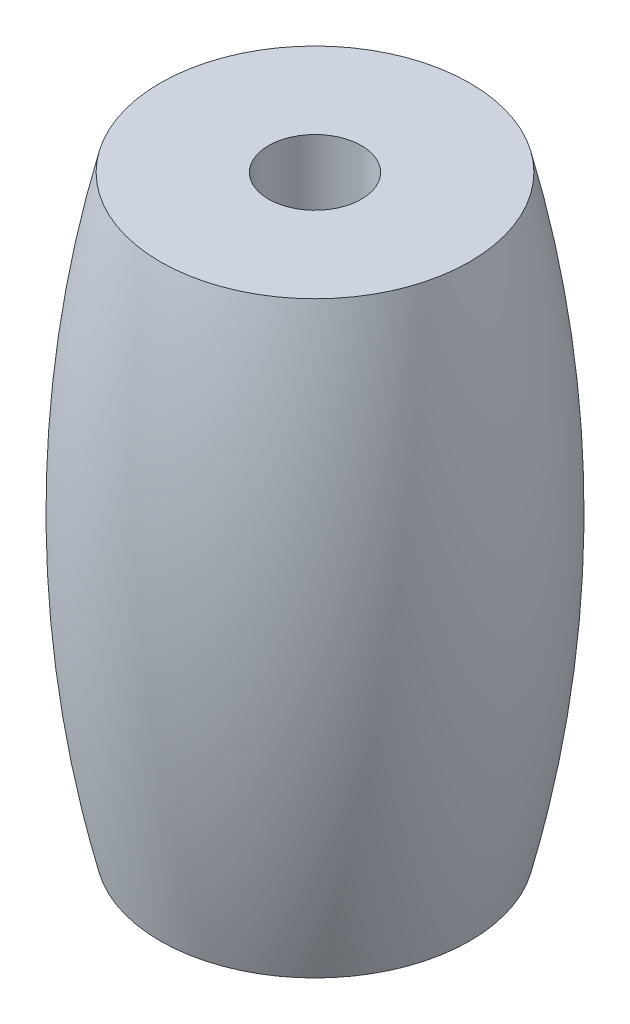
ISO-10303-21;
HEADER;
FILE_DESCRIPTION(('STEP AP214'),'2;1');
FILE_NAME('part.step','',(''),(''),'','','');
FILE_SCHEMA(('AUTOMOTIVE_DESIGN { 1 0 10303 214 1 1 1 1 }'));
ENDSEC;
DATA;
#1=APPLICATION_CONTEXT('core data for automotive mechanical design processes');
#2=APPLICATION_PROTOCOL_DEFINITION('international standard','automotive_design',2000,#1);
#3=PRODUCT_CONTEXT('',#1,'mechanical');
#4=PRODUCT('Part','Part','',(#3));
#5=PRODUCT_RELATED_PRODUCT_CATEGORY('part','',(#4));
#6=PRODUCT_DEFINITION_FORMATION('','',#4);
#7=PRODUCT_DEFINITION_CONTEXT('part definition',#1,'design');
#8=PRODUCT_DEFINITION('design','',#6,#7);
#9=PRODUCT_DEFINITION_SHAPE('','',#8);
#10=(LENGTH_UNIT() NAMED_UNIT(*) SI_UNIT(.MILLI.,.METRE.));
#11=(NAMED_UNIT(*) PLANE_ANGLE_UNIT() SI_UNIT($,.RADIAN.));
#12=(NAMED_UNIT(*) SI_UNIT($,.STERADIAN.) SOLID_ANGLE_UNIT());
#13=UNCERTAINTY_MEASURE_WITH_UNIT(LENGTH_MEASURE(1.E-05),#10,'distance_accuracy_value','');
#14=(GEOMETRIC_REPRESENTATION_CONTEXT(3) GLOBAL_UNCERTAINTY_ASSIGNED_CONTEXT((#13)) GLOBAL_UNIT_ASSIGNED_CONTEXT((#10,
#11,#12)) REPRESENTATION_CONTEXT('',''));
#15=CARTESIAN_POINT('',(0.,0.,0.));
#16=DIRECTION('',(0.,0.,1.));
#17=DIRECTION('',(1.,0.,0.));
#18=AXIS2_PLACEMENT_3D('',#15,#16,#17);
#19=CARTESIAN_POINT('',(-1.5,14.8254716981132,0.));
#20=DIRECTION('',(0.,1.,0.));
#21=DIRECTION('',(0.,0.,1.));
#22=AXIS2_PLACEMENT_3D('',#19,#20,#21);
#23=PLANE('',#22);
#24=CARTESIAN_POINT('',(0.,14.8254716981132,0.));
#25=DIRECTION('',(0.,1.,0.));
#26=DIRECTION('',(0.,0.,1.));
#27=AXIS2_PLACEMENT_3D('',#24,#25,#26);
#28=CIRCLE('',#27,5.);
#29=CARTESIAN_POINT('',(0.,14.8254716981132,5.));
#30=VERTEX_POINT('',#29);
#31=EDGE_CURVE('E10',#30,#30,#28,.T.);
#32=ORIENTED_EDGE('',*,*,#31,.T.);
#33=EDGE_LOOP('',(#32));
#34=FACE_BOUND('',#33,.T.);
#35=CARTESIAN_POINT('',(0.,14.8254716981132,0.));
#36=DIRECTION('',(0.,1.,0.));
#37=DIRECTION('',(0.,0.,1.));
#38=AXIS2_PLACEMENT_3D('',#35,#36,#37);
#39=CIRCLE('',#38,1.5);
#40=CARTESIAN_POINT('',(0.,14.8254716981132,1.5));
#41=VERTEX_POINT('',#40);
#42=EDGE_CURVE('E51',#41,#41,#39,.T.);
#43=ORIENTED_EDGE('',*,*,#42,.F.);
#44=EDGE_LOOP('',(#43));
#45=FACE_BOUND('',#44,.T.);
#46=ADVANCED_FACE('F37',(#34,#45),#23,.T.);
#47=CARTESIAN_POINT('',(0.,5.3254716981132,0.));
#48=DIRECTION('',(0.,1.,0.));
#49=DIRECTION('',(0.,0.,1.));
#50=AXIS2_PLACEMENT_3D('',#47,#48,#49);
#51=DEGENERATE_TOROIDAL_SURFACE('',#50,33.8555015409659,40.,.F.);
#52=CARTESIAN_POINT('',(0.,-4.1745283018868,0.));
#53=DIRECTION('',(0.,1.,0.));
#54=DIRECTION('',(0.,0.,1.));
#55=AXIS2_PLACEMENT_3D('',#52,#53,#54);
#56=CIRCLE('',#55,5.);
#57=CARTESIAN_POINT('',(0.,-4.1745283018868,5.));
#58=VERTEX_POINT('',#57);
#59=EDGE_CURVE('E43',#58,#58,#56,.T.);
#60=ORIENTED_EDGE('',*,*,#59,.T.);
#61=EDGE_LOOP('',(#60));
#62=FACE_BOUND('',#61,.T.);
#63=ORIENTED_EDGE('',*,*,#31,.F.);
#64=EDGE_LOOP('',(#63));
#65=FACE_BOUND('',#64,.T.);
#66=ADVANCED_FACE('F61',(#62,#65),#51,.F.);
#67=CARTESIAN_POINT('',(-1.5,-4.1745283018868,0.));
#68=DIRECTION('',(0.,-1.,0.));
#69=DIRECTION('',(0.,0.,-1.));
#70=AXIS2_PLACEMENT_3D('',#67,#68,#69);
#71=PLANE('',#70);
#72=CARTESIAN_POINT('',(0.,-4.1745283018868,0.));
#73=DIRECTION('',(0.,1.,0.));
#74=DIRECTION('',(0.,0.,1.));
#75=AXIS2_PLACEMENT_3D('',#72,#73,#74);
#76=CIRCLE('',#75,1.5);
#77=CARTESIAN_POINT('',(0.,-4.1745283018868,1.5));
#78=VERTEX_POINT('',#77);
#79=EDGE_CURVE('E47',#78,#78,#76,.T.);
#80=ORIENTED_EDGE('',*,*,#79,.T.);
#81=EDGE_LOOP('',(#80));
#82=FACE_BOUND('',#81,.T.);
#83=ORIENTED_EDGE('',*,*,#59,.F.);
#84=EDGE_LOOP('',(#83));
#85=FACE_BOUND('',#84,.T.);
#86=ADVANCED_FACE('F65',(#82,#85),#71,.T.);
#87=CARTESIAN_POINT('',(0.,17.0979486578357,0.));
#88=DIRECTION('',(0.,1.,0.));
#89=DIRECTION('',(0.,0.,1.));
#90=AXIS2_PLACEMENT_3D('',#87,#88,#89);
#91=CYLINDRICAL_SURFACE('',#90,1.5);
#92=ORIENTED_EDGE('',*,*,#42,.T.);
#93=EDGE_LOOP('',(#92));
#94=FACE_BOUND('',#93,.T.);
#95=ORIENTED_EDGE('',*,*,#79,.F.);
#96=EDGE_LOOP('',(#95));
#97=FACE_BOUND('',#96,.T.);
#98=ADVANCED_FACE('F57',(#94,#97),#91,.F.);
#99=CLOSED_SHELL('',(#46,#66,#86,#98));
#100=MANIFOLD_SOLID_BREP('B2',#99);
#101=ADVANCED_BREP_SHAPE_REPRESENTATION('',(#18,#100),#14);
#102=SHAPE_DEFINITION_REPRESENTATION(#9,#101);
ENDSEC;
END-ISO-10303-21;
